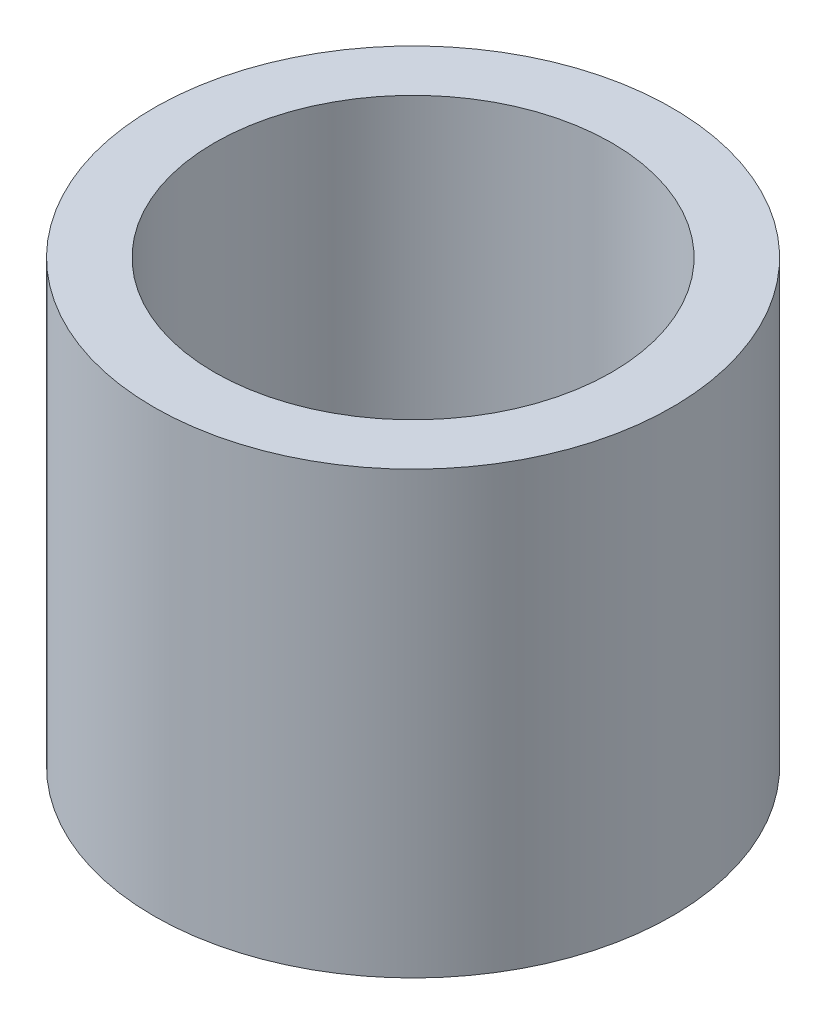
ISO-10303-21;
HEADER;
FILE_DESCRIPTION(('STEP AP214'),'2;1');
FILE_NAME('part.step','',(''),(''),'','','');
FILE_SCHEMA(('AUTOMOTIVE_DESIGN { 1 0 10303 214 1 1 1 1 }'));
ENDSEC;
DATA;
#1=APPLICATION_CONTEXT('core data for automotive mechanical design processes');
#2=APPLICATION_PROTOCOL_DEFINITION('international standard','automotive_design',2000,#1);
#3=PRODUCT_CONTEXT('',#1,'mechanical');
#4=PRODUCT('Part','Part','',(#3));
#5=PRODUCT_RELATED_PRODUCT_CATEGORY('part','',(#4));
#6=PRODUCT_DEFINITION_FORMATION('','',#4);
#7=PRODUCT_DEFINITION_CONTEXT('part definition',#1,'design');
#8=PRODUCT_DEFINITION('design','',#6,#7);
#9=PRODUCT_DEFINITION_SHAPE('','',#8);
#10=(LENGTH_UNIT() NAMED_UNIT(*) SI_UNIT(.MILLI.,.METRE.));
#11=(NAMED_UNIT(*) PLANE_ANGLE_UNIT() SI_UNIT($,.RADIAN.));
#12=(NAMED_UNIT(*) SI_UNIT($,.STERADIAN.) SOLID_ANGLE_UNIT());
#13=UNCERTAINTY_MEASURE_WITH_UNIT(LENGTH_MEASURE(1.E-05),#10,'distance_accuracy_value','');
#14=(GEOMETRIC_REPRESENTATION_CONTEXT(3) GLOBAL_UNCERTAINTY_ASSIGNED_CONTEXT((#13)) GLOBAL_UNIT_ASSIGNED_CONTEXT((#10,
#11,#12)) REPRESENTATION_CONTEXT('',''));
#15=CARTESIAN_POINT('',(0.,0.,0.));
#16=DIRECTION('',(0.,0.,1.));
#17=DIRECTION('',(1.,0.,0.));
#18=AXIS2_PLACEMENT_3D('',#15,#16,#17);
#19=CARTESIAN_POINT('',(0.,7.7724,0.));
#20=DIRECTION('',(0.,1.,0.));
#21=DIRECTION('',(0.,0.,1.));
#22=AXIS2_PLACEMENT_3D('',#19,#20,#21);
#23=PLANE('',#22);
#24=CARTESIAN_POINT('',(0.,7.7724,0.));
#25=DIRECTION('',(0.,1.,0.));
#26=DIRECTION('',(0.,0.,1.));
#27=AXIS2_PLACEMENT_3D('',#24,#25,#26);
#28=CIRCLE('',#27,4.572);
#29=CARTESIAN_POINT('',(0.,7.7724,4.572));
#30=VERTEX_POINT('',#29);
#31=EDGE_CURVE('E10',#30,#30,#28,.T.);
#32=ORIENTED_EDGE('',*,*,#31,.T.);
#33=EDGE_LOOP('',(#32));
#34=FACE_BOUND('',#33,.T.);
#35=CARTESIAN_POINT('',(0.,7.7724,0.));
#36=DIRECTION('',(0.,1.,0.));
#37=DIRECTION('',(0.,0.,1.));
#38=AXIS2_PLACEMENT_3D('',#35,#36,#37);
#39=CIRCLE('',#38,3.5052);
#40=CARTESIAN_POINT('',(0.,7.7724,3.5052));
#41=VERTEX_POINT('',#40);
#42=EDGE_CURVE('E39',#41,#41,#39,.T.);
#43=ORIENTED_EDGE('',*,*,#42,.F.);
#44=EDGE_LOOP('',(#43));
#45=FACE_BOUND('',#44,.T.);
#46=ADVANCED_FACE('F28',(#34,#45),#23,.T.);
#47=CARTESIAN_POINT('',(0.,0.,0.));
#48=DIRECTION('',(0.,1.,0.));
#49=DIRECTION('',(0.,0.,1.));
#50=AXIS2_PLACEMENT_3D('',#47,#48,#49);
#51=PLANE('',#50);
#52=CARTESIAN_POINT('',(0.,0.,0.));
#53=DIRECTION('',(0.,1.,0.));
#54=DIRECTION('',(0.,0.,1.));
#55=AXIS2_PLACEMENT_3D('',#52,#53,#54);
#56=CIRCLE('',#55,4.572);
#57=CARTESIAN_POINT('',(0.,0.,4.572));
#58=VERTEX_POINT('',#57);
#59=EDGE_CURVE('E32',#58,#58,#56,.T.);
#60=ORIENTED_EDGE('',*,*,#59,.F.);
#61=EDGE_LOOP('',(#60));
#62=FACE_BOUND('',#61,.T.);
#63=CARTESIAN_POINT('',(0.,0.,0.));
#64=DIRECTION('',(0.,1.,0.));
#65=DIRECTION('',(0.,0.,1.));
#66=AXIS2_PLACEMENT_3D('',#63,#64,#65);
#67=CIRCLE('',#66,3.5052);
#68=CARTESIAN_POINT('',(0.,0.,3.5052));
#69=VERTEX_POINT('',#68);
#70=EDGE_CURVE('E41',#69,#69,#67,.T.);
#71=ORIENTED_EDGE('',*,*,#70,.T.);
#72=EDGE_LOOP('',(#71));
#73=FACE_BOUND('',#72,.T.);
#74=ADVANCED_FACE('F51',(#62,#73),#51,.F.);
#75=CARTESIAN_POINT('',(0.,7.7724,0.));
#76=DIRECTION('',(0.,-1.,0.));
#77=DIRECTION('',(0.,0.,-1.));
#78=AXIS2_PLACEMENT_3D('',#75,#76,#77);
#79=CYLINDRICAL_SURFACE('',#78,4.572);
#80=ORIENTED_EDGE('',*,*,#31,.F.);
#81=EDGE_LOOP('',(#80));
#82=FACE_BOUND('',#81,.T.);
#83=ORIENTED_EDGE('',*,*,#59,.T.);
#84=EDGE_LOOP('',(#83));
#85=FACE_BOUND('',#84,.T.);
#86=ADVANCED_FACE('F30',(#82,#85),#79,.T.);
#87=CARTESIAN_POINT('',(0.,7.7724,0.));
#88=DIRECTION('',(0.,-1.,0.));
#89=DIRECTION('',(0.,0.,-1.));
#90=AXIS2_PLACEMENT_3D('',#87,#88,#89);
#91=CYLINDRICAL_SURFACE('',#90,3.5052);
#92=ORIENTED_EDGE('',*,*,#42,.T.);
#93=EDGE_LOOP('',(#92));
#94=FACE_BOUND('',#93,.T.);
#95=ORIENTED_EDGE('',*,*,#70,.F.);
#96=EDGE_LOOP('',(#95));
#97=FACE_BOUND('',#96,.T.);
#98=ADVANCED_FACE('F47',(#94,#97),#91,.F.);
#99=CLOSED_SHELL('',(#46,#74,#86,#98));
#100=MANIFOLD_SOLID_BREP('B2',#99);
#101=ADVANCED_BREP_SHAPE_REPRESENTATION('',(#18,#100),#14);
#102=SHAPE_DEFINITION_REPRESENTATION(#9,#101);
ENDSEC;
END-ISO-10303-21;
